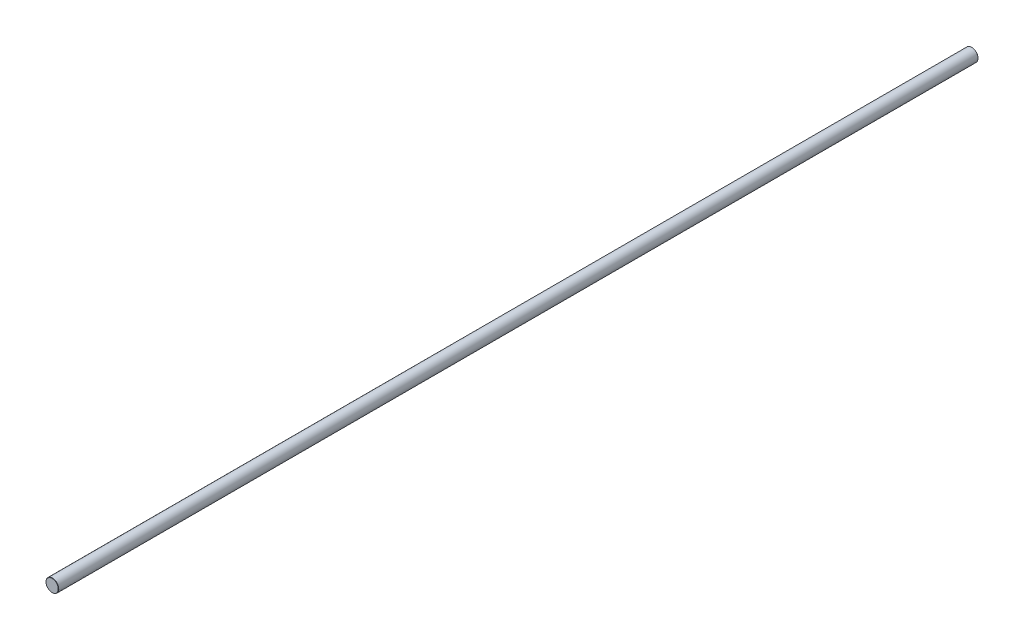
ISO-10303-21;
HEADER;
FILE_DESCRIPTION(('STEP AP214'),'2;1');
FILE_NAME('part.step','',(''),(''),'','','');
FILE_SCHEMA(('AUTOMOTIVE_DESIGN { 1 0 10303 214 1 1 1 1 }'));
ENDSEC;
DATA;
#1=APPLICATION_CONTEXT('core data for automotive mechanical design processes');
#2=APPLICATION_PROTOCOL_DEFINITION('international standard','automotive_design',2000,#1);
#3=PRODUCT_CONTEXT('',#1,'mechanical');
#4=PRODUCT('Part','Part','',(#3));
#5=PRODUCT_RELATED_PRODUCT_CATEGORY('part','',(#4));
#6=PRODUCT_DEFINITION_FORMATION('','',#4);
#7=PRODUCT_DEFINITION_CONTEXT('part definition',#1,'design');
#8=PRODUCT_DEFINITION('design','',#6,#7);
#9=PRODUCT_DEFINITION_SHAPE('','',#8);
#10=(LENGTH_UNIT() NAMED_UNIT(*) SI_UNIT(.MILLI.,.METRE.));
#11=(NAMED_UNIT(*) PLANE_ANGLE_UNIT() SI_UNIT($,.RADIAN.));
#12=(NAMED_UNIT(*) SI_UNIT($,.STERADIAN.) SOLID_ANGLE_UNIT());
#13=UNCERTAINTY_MEASURE_WITH_UNIT(LENGTH_MEASURE(1.E-05),#10,'distance_accuracy_value','');
#14=(GEOMETRIC_REPRESENTATION_CONTEXT(3) GLOBAL_UNCERTAINTY_ASSIGNED_CONTEXT((#13)) GLOBAL_UNIT_ASSIGNED_CONTEXT((#10,
#11,#12)) REPRESENTATION_CONTEXT('',''));
#15=CARTESIAN_POINT('',(0.,0.,0.));
#16=DIRECTION('',(0.,0.,1.));
#17=DIRECTION('',(1.,0.,0.));
#18=AXIS2_PLACEMENT_3D('',#15,#16,#17);
#19=CARTESIAN_POINT('',(0.,0.,457.2));
#20=DIRECTION('',(0.,0.,-1.));
#21=DIRECTION('',(-1.,0.,0.));
#22=AXIS2_PLACEMENT_3D('',#19,#20,#21);
#23=CYLINDRICAL_SURFACE('',#22,6.35);
#24=CARTESIAN_POINT('',(0.,0.,-456.946));
#25=DIRECTION('',(0.,0.,1.));
#26=DIRECTION('',(1.,0.,0.));
#27=AXIS2_PLACEMENT_3D('',#24,#25,#26);
#28=CIRCLE('',#27,6.35);
#29=CARTESIAN_POINT('',(6.35,0.,-456.946));
#30=VERTEX_POINT('',#29);
#31=EDGE_CURVE('E54',#30,#30,#28,.T.);
#32=ORIENTED_EDGE('',*,*,#31,.T.);
#33=EDGE_LOOP('',(#32));
#34=FACE_BOUND('',#33,.T.);
#35=CARTESIAN_POINT('',(0.,0.,456.946));
#36=DIRECTION('',(0.,0.,1.));
#37=DIRECTION('',(1.,0.,0.));
#38=AXIS2_PLACEMENT_3D('',#35,#36,#37);
#39=CIRCLE('',#38,6.35);
#40=CARTESIAN_POINT('',(6.35,0.,456.946));
#41=VERTEX_POINT('',#40);
#42=EDGE_CURVE('E59',#41,#41,#39,.F.);
#43=ORIENTED_EDGE('',*,*,#42,.T.);
#44=EDGE_LOOP('',(#43));
#45=FACE_BOUND('',#44,.T.);
#46=ADVANCED_FACE('F41',(#34,#45),#23,.T.);
#47=CARTESIAN_POINT('',(0.,0.,457.2));
#48=DIRECTION('',(0.,0.,1.));
#49=DIRECTION('',(1.,0.,0.));
#50=AXIS2_PLACEMENT_3D('',#47,#48,#49);
#51=PLANE('',#50);
#52=CARTESIAN_POINT('',(0.,0.,457.2));
#53=DIRECTION('',(0.,0.,1.));
#54=DIRECTION('',(1.,0.,0.));
#55=AXIS2_PLACEMENT_3D('',#52,#53,#54);
#56=CIRCLE('',#55,6.0960000000001);
#57=CARTESIAN_POINT('',(6.0960000000001,0.,457.2));
#58=VERTEX_POINT('',#57);
#59=EDGE_CURVE('E10',#58,#58,#56,.T.);
#60=ORIENTED_EDGE('',*,*,#59,.T.);
#61=EDGE_LOOP('',(#60));
#62=FACE_BOUND('',#61,.T.);
#63=ADVANCED_FACE('F76',(#62),#51,.T.);
#64=CARTESIAN_POINT('',(0.,0.,-457.2));
#65=DIRECTION('',(0.,0.,1.));
#66=DIRECTION('',(1.,0.,0.));
#67=AXIS2_PLACEMENT_3D('',#64,#65,#66);
#68=PLANE('',#67);
#69=CARTESIAN_POINT('',(0.,0.,-457.2));
#70=DIRECTION('',(0.,0.,1.));
#71=DIRECTION('',(1.,0.,0.));
#72=AXIS2_PLACEMENT_3D('',#69,#70,#71);
#73=CIRCLE('',#72,6.09599999999999);
#74=CARTESIAN_POINT('',(6.09599999999999,0.,-457.2));
#75=VERTEX_POINT('',#74);
#76=EDGE_CURVE('E49',#75,#75,#73,.F.);
#77=ORIENTED_EDGE('',*,*,#76,.T.);
#78=EDGE_LOOP('',(#77));
#79=FACE_BOUND('',#78,.T.);
#80=ADVANCED_FACE('F73',(#79),#68,.F.);
#81=CARTESIAN_POINT('',(0.,0.,-456.946));
#82=DIRECTION('',(0.,0.,1.));
#83=DIRECTION('',(1.,0.,0.));
#84=AXIS2_PLACEMENT_3D('',#81,#82,#83);
#85=CONICAL_SURFACE('',#84,6.35,0.785398163397295);
#86=ORIENTED_EDGE('',*,*,#76,.F.);
#87=EDGE_LOOP('',(#86));
#88=FACE_BOUND('',#87,.T.);
#89=ORIENTED_EDGE('',*,*,#31,.F.);
#90=EDGE_LOOP('',(#89));
#91=FACE_BOUND('',#90,.T.);
#92=ADVANCED_FACE('F69',(#88,#91),#85,.T.);
#93=CARTESIAN_POINT('',(0.,0.,457.2));
#94=DIRECTION('',(0.,0.,-1.));
#95=DIRECTION('',(-1.,0.,0.));
#96=AXIS2_PLACEMENT_3D('',#93,#94,#95);
#97=CONICAL_SURFACE('',#96,6.0960000000001,0.785398163397404);
#98=ORIENTED_EDGE('',*,*,#42,.F.);
#99=EDGE_LOOP('',(#98));
#100=FACE_BOUND('',#99,.T.);
#101=ORIENTED_EDGE('',*,*,#59,.F.);
#102=EDGE_LOOP('',(#101));
#103=FACE_BOUND('',#102,.T.);
#104=ADVANCED_FACE('F43',(#100,#103),#97,.T.);
#105=CLOSED_SHELL('',(#46,#63,#80,#92,#104));
#106=MANIFOLD_SOLID_BREP('B2',#105);
#107=ADVANCED_BREP_SHAPE_REPRESENTATION('',(#18,#106),#14);
#108=SHAPE_DEFINITION_REPRESENTATION(#9,#107);
ENDSEC;
END-ISO-10303-21;
